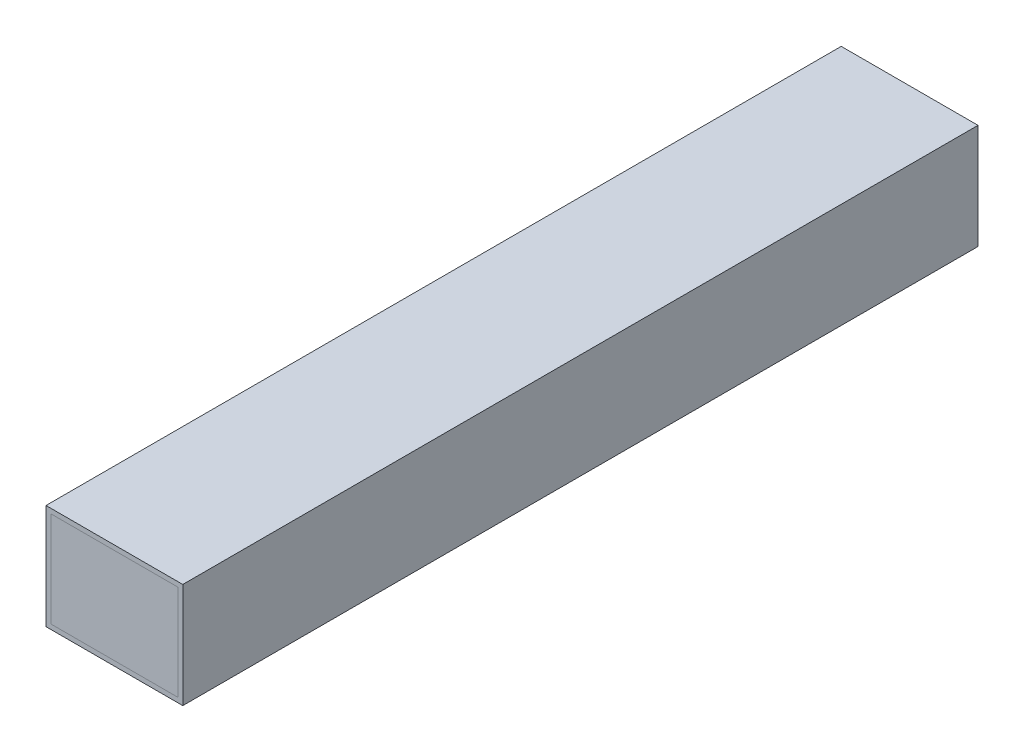
ISO-10303-21;
HEADER;
FILE_DESCRIPTION(('STEP AP214'),'2;1');
FILE_NAME('part.step','',(''),(''),'','','');
FILE_SCHEMA(('AUTOMOTIVE_DESIGN { 1 0 10303 214 1 1 1 1 }'));
ENDSEC;
DATA;
#1=APPLICATION_CONTEXT('core data for automotive mechanical design processes');
#2=APPLICATION_PROTOCOL_DEFINITION('international standard','automotive_design',2000,#1);
#3=PRODUCT_CONTEXT('',#1,'mechanical');
#4=PRODUCT('Part','Part','',(#3));
#5=PRODUCT_RELATED_PRODUCT_CATEGORY('part','',(#4));
#6=PRODUCT_DEFINITION_FORMATION('','',#4);
#7=PRODUCT_DEFINITION_CONTEXT('part definition',#1,'design');
#8=PRODUCT_DEFINITION('design','',#6,#7);
#9=PRODUCT_DEFINITION_SHAPE('','',#8);
#10=(LENGTH_UNIT() NAMED_UNIT(*) SI_UNIT(.MILLI.,.METRE.));
#11=(NAMED_UNIT(*) PLANE_ANGLE_UNIT() SI_UNIT($,.RADIAN.));
#12=(NAMED_UNIT(*) SI_UNIT($,.STERADIAN.) SOLID_ANGLE_UNIT());
#13=UNCERTAINTY_MEASURE_WITH_UNIT(LENGTH_MEASURE(1.E-05),#10,'distance_accuracy_value','');
#14=(GEOMETRIC_REPRESENTATION_CONTEXT(3) GLOBAL_UNCERTAINTY_ASSIGNED_CONTEXT((#13)) GLOBAL_UNIT_ASSIGNED_CONTEXT((#10,
#11,#12)) REPRESENTATION_CONTEXT('',''));
#15=CARTESIAN_POINT('',(0.,0.,0.));
#16=DIRECTION('',(0.,0.,1.));
#17=DIRECTION('',(1.,0.,0.));
#18=AXIS2_PLACEMENT_3D('',#15,#16,#17);
#19=CARTESIAN_POINT('',(-20.,15.,125.));
#20=DIRECTION('',(1.,0.,0.));
#21=DIRECTION('',(0.,0.,-1.));
#22=AXIS2_PLACEMENT_3D('',#19,#20,#21);
#23=PLANE('',#22);
#24=DIRECTION('',(0.,-1.,0.));
#25=VECTOR('',#24,1.);
#26=CARTESIAN_POINT('',(-20.,15.,-125.));
#27=LINE('',#26,#25);
#28=CARTESIAN_POINT('',(-20.,15.,-125.));
#29=VERTEX_POINT('',#28);
#30=CARTESIAN_POINT('',(-20.,-16.000580385734,-125.));
#31=VERTEX_POINT('',#30);
#32=EDGE_CURVE('E135',#29,#31,#27,.T.);
#33=ORIENTED_EDGE('',*,*,#32,.T.);
#34=DIRECTION('',(0.,0.,-1.));
#35=VECTOR('',#34,1.);
#36=CARTESIAN_POINT('',(-20.,-16.000580385734,125.));
#37=LINE('',#36,#35);
#38=CARTESIAN_POINT('',(-20.,-16.000580385734,125.));
#39=VERTEX_POINT('',#38);
#40=EDGE_CURVE('E13',#39,#31,#37,.T.);
#41=ORIENTED_EDGE('',*,*,#40,.F.);
#42=DIRECTION('',(0.,-1.,0.));
#43=VECTOR('',#42,1.);
#44=CARTESIAN_POINT('',(-20.,15.,125.));
#45=LINE('',#44,#43);
#46=CARTESIAN_POINT('',(-20.,15.,125.));
#47=VERTEX_POINT('',#46);
#48=EDGE_CURVE('E123',#47,#39,#45,.T.);
#49=ORIENTED_EDGE('',*,*,#48,.F.);
#50=DIRECTION('',(0.,0.,-1.));
#51=VECTOR('',#50,1.);
#52=CARTESIAN_POINT('',(-20.,15.,125.));
#53=LINE('',#52,#51);
#54=EDGE_CURVE('E131',#47,#29,#53,.T.);
#55=ORIENTED_EDGE('',*,*,#54,.T.);
#56=EDGE_LOOP('',(#33,#41,#49,#55));
#57=FACE_BOUND('',#56,.T.);
#58=ADVANCED_FACE('F72',(#57),#23,.F.);
#59=CARTESIAN_POINT('',(-20.,-16.000580385734,125.));
#60=DIRECTION('',(0.,1.,0.));
#61=DIRECTION('',(0.,0.,1.));
#62=AXIS2_PLACEMENT_3D('',#59,#60,#61);
#63=PLANE('',#62);
#64=DIRECTION('',(1.,0.,0.));
#65=VECTOR('',#64,1.);
#66=CARTESIAN_POINT('',(-20.,-16.000580385734,-125.));
#67=LINE('',#66,#65);
#68=CARTESIAN_POINT('',(19.9966618023375,-16.000580385734,-125.));
#69=VERTEX_POINT('',#68);
#70=EDGE_CURVE('E127',#31,#69,#67,.T.);
#71=ORIENTED_EDGE('',*,*,#70,.T.);
#72=DIRECTION('',(0.,0.,-1.));
#73=VECTOR('',#72,1.);
#74=CARTESIAN_POINT('',(19.9966618023375,-16.000580385734,125.));
#75=LINE('',#74,#73);
#76=CARTESIAN_POINT('',(19.9966618023375,-16.000580385734,125.));
#77=VERTEX_POINT('',#76);
#78=EDGE_CURVE('E80',#77,#69,#75,.T.);
#79=ORIENTED_EDGE('',*,*,#78,.F.);
#80=DIRECTION('',(1.,0.,0.));
#81=VECTOR('',#80,1.);
#82=CARTESIAN_POINT('',(-20.,-16.000580385734,125.));
#83=LINE('',#82,#81);
#84=EDGE_CURVE('E118',#39,#77,#83,.T.);
#85=ORIENTED_EDGE('',*,*,#84,.F.);
#86=ORIENTED_EDGE('',*,*,#40,.T.);
#87=EDGE_LOOP('',(#71,#79,#85,#86));
#88=FACE_BOUND('',#87,.T.);
#89=ADVANCED_FACE('F126',(#88),#63,.F.);
#90=CARTESIAN_POINT('',(19.9966618023375,15.,125.));
#91=DIRECTION('',(-1.,0.,0.));
#92=DIRECTION('',(0.,-1.,0.));
#93=AXIS2_PLACEMENT_3D('',#90,#91,#92);
#94=PLANE('',#93);
#95=DIRECTION('',(0.,1.,0.));
#96=VECTOR('',#95,1.);
#97=CARTESIAN_POINT('',(19.9966618023375,15.,-125.));
#98=LINE('',#97,#96);
#99=CARTESIAN_POINT('',(19.9966618023375,15.,-125.));
#100=VERTEX_POINT('',#99);
#101=EDGE_CURVE('E105',#69,#100,#98,.T.);
#102=ORIENTED_EDGE('',*,*,#101,.T.);
#103=DIRECTION('',(0.,0.,-1.));
#104=VECTOR('',#103,1.);
#105=CARTESIAN_POINT('',(19.9966618023375,15.,125.));
#106=LINE('',#105,#104);
#107=CARTESIAN_POINT('',(19.9966618023375,15.,125.));
#108=VERTEX_POINT('',#107);
#109=EDGE_CURVE('E128',#108,#100,#106,.T.);
#110=ORIENTED_EDGE('',*,*,#109,.F.);
#111=DIRECTION('',(0.,1.,0.));
#112=VECTOR('',#111,1.);
#113=CARTESIAN_POINT('',(19.9966618023375,15.,125.));
#114=LINE('',#113,#112);
#115=EDGE_CURVE('E121',#77,#108,#114,.T.);
#116=ORIENTED_EDGE('',*,*,#115,.F.);
#117=ORIENTED_EDGE('',*,*,#78,.T.);
#118=EDGE_LOOP('',(#102,#110,#116,#117));
#119=FACE_BOUND('',#118,.T.);
#120=ADVANCED_FACE('F129',(#119),#94,.F.);
#121=CARTESIAN_POINT('',(-20.,15.,125.));
#122=DIRECTION('',(0.,-1.,0.));
#123=DIRECTION('',(0.,0.,-1.));
#124=AXIS2_PLACEMENT_3D('',#121,#122,#123);
#125=PLANE('',#124);
#126=DIRECTION('',(-1.,0.,0.));
#127=VECTOR('',#126,1.);
#128=CARTESIAN_POINT('',(-20.,15.,-125.));
#129=LINE('',#128,#127);
#130=EDGE_CURVE('E111',#100,#29,#129,.T.);
#131=ORIENTED_EDGE('',*,*,#130,.T.);
#132=ORIENTED_EDGE('',*,*,#54,.F.);
#133=DIRECTION('',(-1.,0.,0.));
#134=VECTOR('',#133,1.);
#135=CARTESIAN_POINT('',(-20.,15.,125.));
#136=LINE('',#135,#134);
#137=EDGE_CURVE('E88',#108,#47,#136,.T.);
#138=ORIENTED_EDGE('',*,*,#137,.F.);
#139=ORIENTED_EDGE('',*,*,#109,.T.);
#140=EDGE_LOOP('',(#131,#132,#138,#139));
#141=FACE_BOUND('',#140,.T.);
#142=ADVANCED_FACE('F142',(#141),#125,.F.);
#143=CARTESIAN_POINT('',(0.,0.,125.));
#144=DIRECTION('',(0.,0.,1.));
#145=DIRECTION('',(1.,0.,0.));
#146=AXIS2_PLACEMENT_3D('',#143,#144,#145);
#147=PLANE('',#146);
#148=ORIENTED_EDGE('',*,*,#48,.T.);
#149=ORIENTED_EDGE('',*,*,#84,.T.);
#150=ORIENTED_EDGE('',*,*,#115,.T.);
#151=ORIENTED_EDGE('',*,*,#137,.T.);
#152=EDGE_LOOP('',(#148,#149,#150,#151));
#153=FACE_BOUND('',#152,.T.);
#154=ADVANCED_FACE('F119',(#153),#147,.T.);
#155=CARTESIAN_POINT('',(0.,0.,-125.));
#156=DIRECTION('',(0.,0.,1.));
#157=DIRECTION('',(1.,0.,0.));
#158=AXIS2_PLACEMENT_3D('',#155,#156,#157);
#159=PLANE('',#158);
#160=ORIENTED_EDGE('',*,*,#32,.F.);
#161=ORIENTED_EDGE('',*,*,#130,.F.);
#162=ORIENTED_EDGE('',*,*,#101,.F.);
#163=ORIENTED_EDGE('',*,*,#70,.F.);
#164=EDGE_LOOP('',(#160,#161,#162,#163));
#165=FACE_BOUND('',#164,.T.);
#166=ADVANCED_FACE('F145',(#165),#159,.F.);
#167=CLOSED_SHELL('',(#58,#89,#120,#142,#154,#166));
#168=MANIFOLD_SOLID_BREP('B2',#167);
#169=CARTESIAN_POINT('',(0.,0.,100.));
#170=DIRECTION('',(0.,0.,1.));
#171=DIRECTION('',(1.,0.,0.));
#172=AXIS2_PLACEMENT_3D('',#169,#170,#171);
#173=CYLINDRICAL_SURFACE('',#172,0.300000000000001);
#174=CARTESIAN_POINT('',(0.,0.,90.0006526384106));
#175=DIRECTION('',(0.,0.,1.));
#176=DIRECTION('',(1.,0.,0.));
#177=AXIS2_PLACEMENT_3D('',#174,#175,#176);
#178=CIRCLE('',#177,0.300000000000003);
#179=CARTESIAN_POINT('',(0.300000000000003,0.,90.0006526384106));
#180=VERTEX_POINT('',#179);
#181=EDGE_CURVE('E227',#180,#180,#178,.T.);
#182=ORIENTED_EDGE('',*,*,#181,.F.);
#183=EDGE_LOOP('',(#182));
#184=FACE_BOUND('',#183,.T.);
#185=CARTESIAN_POINT('',(0.,0.,-33.0761005211329));
#186=DIRECTION('',(0.,0.,-1.));
#187=DIRECTION('',(-1.,0.,0.));
#188=AXIS2_PLACEMENT_3D('',#185,#186,#187);
#189=CIRCLE('',#188,0.300000000000001);
#190=CARTESIAN_POINT('',(-0.300000000000001,0.,-33.0761005211329));
#191=VERTEX_POINT('',#190);
#192=EDGE_CURVE('E70',#191,#191,#189,.F.);
#193=ORIENTED_EDGE('',*,*,#192,.T.);
#194=EDGE_LOOP('',(#193));
#195=FACE_BOUND('',#194,.T.);
#196=ADVANCED_FACE('F205',(#184,#195),#173,.T.);
#197=CARTESIAN_POINT('',(0.,0.,90.0006526384106));
#198=DIRECTION('',(0.,0.,1.));
#199=DIRECTION('',(1.,0.,0.));
#200=AXIS2_PLACEMENT_3D('',#197,#198,#199);
#201=TOROIDAL_SURFACE('',#200,0.35,0.0499999999999973);
#202=CARTESIAN_POINT('',(0.,0.,90.0506526384106));
#203=DIRECTION('',(0.,0.,1.));
#204=DIRECTION('',(1.,0.,0.));
#205=AXIS2_PLACEMENT_3D('',#202,#203,#204);
#206=CIRCLE('',#205,0.35);
#207=CARTESIAN_POINT('',(0.35,0.,90.0506526384106));
#208=VERTEX_POINT('',#207);
#209=EDGE_CURVE('E224',#208,#208,#206,.T.);
#210=ORIENTED_EDGE('',*,*,#209,.F.);
#211=EDGE_LOOP('',(#210));
#212=FACE_BOUND('',#211,.T.);
#213=ORIENTED_EDGE('',*,*,#181,.T.);
#214=EDGE_LOOP('',(#213));
#215=FACE_BOUND('',#214,.T.);
#216=ADVANCED_FACE('F245',(#212,#215),#201,.F.);
#217=CARTESIAN_POINT('',(-2.64008499641477,0.,90.0506526384106));
#218=DIRECTION('',(0.,0.,1.));
#219=DIRECTION('',(1.,0.,0.));
#220=AXIS2_PLACEMENT_3D('',#217,#218,#219);
#221=PLANE('',#220);
#222=CARTESIAN_POINT('',(0.,0.,90.0506526384106));
#223=DIRECTION('',(0.,0.,1.));
#224=DIRECTION('',(1.,0.,0.));
#225=AXIS2_PLACEMENT_3D('',#222,#223,#224);
#226=CIRCLE('',#225,2.64008499641477);
#227=CARTESIAN_POINT('',(2.64008499641477,0.,90.0506526384106));
#228=VERTEX_POINT('',#227);
#229=EDGE_CURVE('E222',#228,#228,#226,.T.);
#230=ORIENTED_EDGE('',*,*,#229,.F.);
#231=EDGE_LOOP('',(#230));
#232=FACE_BOUND('',#231,.T.);
#233=ORIENTED_EDGE('',*,*,#209,.T.);
#234=EDGE_LOOP('',(#233));
#235=FACE_BOUND('',#234,.T.);
#236=ADVANCED_FACE('F218',(#232,#235),#221,.F.);
#237=CARTESIAN_POINT('',(0.,0.,90.0506526384106));
#238=DIRECTION('',(0.,0.,-1.));
#239=DIRECTION('',(-1.,0.,0.));
#240=AXIS2_PLACEMENT_3D('',#237,#238,#239);
#241=CONICAL_SURFACE('',#240,2.64008499641477,0.259375146902593);
#242=CARTESIAN_POINT('',(0.,0.,100.));
#243=VERTEX_POINT('',#242);
#244=VERTEX_LOOP('',#243);
#245=FACE_BOUND('',#244,.T.);
#246=ORIENTED_EDGE('',*,*,#229,.T.);
#247=EDGE_LOOP('',(#246));
#248=FACE_BOUND('',#247,.T.);
#249=ADVANCED_FACE('F215',(#245,#248),#241,.T.);
#250=CARTESIAN_POINT('',(0.,0.,-40.7234793438795));
#251=DIRECTION('',(-1.,0.,0.));
#252=DIRECTION('',(0.,0.,-1.));
#253=AXIS2_PLACEMENT_3D('',#250,#251,#252);
#254=SPHERICAL_SURFACE('',#253,7.65326092973403);
#255=CARTESIAN_POINT('',(0.,0.,-40.7234793438795));
#256=DIRECTION('',(0.,0.,1.));
#257=DIRECTION('',(1.,0.,0.));
#258=AXIS2_PLACEMENT_3D('',#255,#256,#257);
#259=SPHERICAL_SURFACE('',#258,7.65326092973403);
#260=CARTESIAN_POINT('',(0.,0.,-48.3708581666261));
#261=DIRECTION('',(0.,0.,1.));
#262=DIRECTION('',(1.,0.,0.));
#263=AXIS2_PLACEMENT_3D('',#260,#261,#262);
#264=CIRCLE('',#263,0.300000000000001);
#265=CARTESIAN_POINT('',(0.300000000000001,0.,-48.3708581666261));
#266=VERTEX_POINT('',#265);
#267=EDGE_CURVE('E212',#266,#266,#264,.F.);
#268=ORIENTED_EDGE('',*,*,#267,.F.);
#269=EDGE_LOOP('',(#268));
#270=FACE_BOUND('',#269,.T.);
#271=ORIENTED_EDGE('',*,*,#192,.F.);
#272=EDGE_LOOP('',(#271));
#273=FACE_BOUND('',#272,.T.);
#274=ADVANCED_FACE('F207',(#270,#273),#259,.T.);
#275=CARTESIAN_POINT('',(0.,0.,-100.));
#276=DIRECTION('',(0.,0.,1.));
#277=DIRECTION('',(1.,0.,0.));
#278=AXIS2_PLACEMENT_3D('',#275,#276,#277);
#279=PLANE('',#278);
#280=CARTESIAN_POINT('',(0.,0.,-100.));
#281=DIRECTION('',(0.,0.,1.));
#282=DIRECTION('',(1.,0.,0.));
#283=AXIS2_PLACEMENT_3D('',#280,#281,#282);
#284=CIRCLE('',#283,0.3);
#285=CARTESIAN_POINT('',(0.3,0.,-100.));
#286=VERTEX_POINT('',#285);
#287=EDGE_CURVE('E232',#286,#286,#284,.T.);
#288=ORIENTED_EDGE('',*,*,#287,.F.);
#289=EDGE_LOOP('',(#288));
#290=FACE_BOUND('',#289,.T.);
#291=ADVANCED_FACE('F241',(#290),#279,.F.);
#292=ORIENTED_EDGE('',*,*,#287,.T.);
#293=EDGE_LOOP('',(#292));
#294=FACE_BOUND('',#293,.T.);
#295=ORIENTED_EDGE('',*,*,#267,.T.);
#296=EDGE_LOOP('',(#295));
#297=FACE_BOUND('',#296,.T.);
#298=ADVANCED_FACE('F237',(#294,#297),#173,.T.);
#299=CLOSED_SHELL('',(#196,#216,#236,#249,#274,#291,#298));
#300=MANIFOLD_SOLID_BREP('B7',#299);
#301=CARTESIAN_POINT('',(20.,-15.,-25.));
#302=DIRECTION('',(0.,0.,-1.));
#303=DIRECTION('',(-1.,0.,0.));
#304=AXIS2_PLACEMENT_3D('',#301,#302,#303);
#305=PLANE('',#304);
#306=DIRECTION('',(0.,-1.,0.));
#307=VECTOR('',#306,1.);
#308=CARTESIAN_POINT('',(-20.,-15.,-25.));
#309=LINE('',#308,#307);
#310=CARTESIAN_POINT('',(-20.,-15.,-25.));
#311=VERTEX_POINT('',#310);
#312=CARTESIAN_POINT('',(-20.,-16.,-25.));
#313=VERTEX_POINT('',#312);
#314=EDGE_CURVE('E379',#311,#313,#309,.T.);
#315=ORIENTED_EDGE('',*,*,#314,.T.);
#316=DIRECTION('',(-1.,0.,0.));
#317=VECTOR('',#316,1.);
#318=CARTESIAN_POINT('',(20.,-16.,-25.));
#319=LINE('',#318,#317);
#320=CARTESIAN_POINT('',(20.,-16.,-25.));
#321=VERTEX_POINT('',#320);
#322=EDGE_CURVE('E203',#321,#313,#319,.T.);
#323=ORIENTED_EDGE('',*,*,#322,.F.);
#324=DIRECTION('',(0.,-1.,0.));
#325=VECTOR('',#324,1.);
#326=CARTESIAN_POINT('',(20.,-15.,-25.));
#327=LINE('',#326,#325);
#328=CARTESIAN_POINT('',(20.,-15.,-25.));
#329=VERTEX_POINT('',#328);
#330=EDGE_CURVE('E367',#329,#321,#327,.T.);
#331=ORIENTED_EDGE('',*,*,#330,.F.);
#332=DIRECTION('',(-1.,0.,0.));
#333=VECTOR('',#332,1.);
#334=CARTESIAN_POINT('',(20.,-15.,-25.));
#335=LINE('',#334,#333);
#336=EDGE_CURVE('E375',#329,#311,#335,.T.);
#337=ORIENTED_EDGE('',*,*,#336,.T.);
#338=EDGE_LOOP('',(#315,#323,#331,#337));
#339=FACE_BOUND('',#338,.T.);
#340=ADVANCED_FACE('F316',(#339),#305,.F.);
#341=CARTESIAN_POINT('',(20.,-16.,-25.));
#342=DIRECTION('',(0.,1.,0.));
#343=DIRECTION('',(0.,0.,1.));
#344=AXIS2_PLACEMENT_3D('',#341,#342,#343);
#345=PLANE('',#344);
#346=DIRECTION('',(0.,0.,-1.));
#347=VECTOR('',#346,1.);
#348=CARTESIAN_POINT('',(-20.,-16.,-25.));
#349=LINE('',#348,#347);
#350=CARTESIAN_POINT('',(-20.,-16.,-55.));
#351=VERTEX_POINT('',#350);
#352=EDGE_CURVE('E371',#313,#351,#349,.T.);
#353=ORIENTED_EDGE('',*,*,#352,.T.);
#354=DIRECTION('',(-1.,0.,0.));
#355=VECTOR('',#354,1.);
#356=CARTESIAN_POINT('',(20.,-16.,-55.));
#357=LINE('',#356,#355);
#358=CARTESIAN_POINT('',(20.,-16.,-55.));
#359=VERTEX_POINT('',#358);
#360=EDGE_CURVE('E324',#359,#351,#357,.T.);
#361=ORIENTED_EDGE('',*,*,#360,.F.);
#362=DIRECTION('',(0.,0.,-1.));
#363=VECTOR('',#362,1.);
#364=CARTESIAN_POINT('',(20.,-16.,-25.));
#365=LINE('',#364,#363);
#366=EDGE_CURVE('E362',#321,#359,#365,.T.);
#367=ORIENTED_EDGE('',*,*,#366,.F.);
#368=ORIENTED_EDGE('',*,*,#322,.T.);
#369=EDGE_LOOP('',(#353,#361,#367,#368));
#370=FACE_BOUND('',#369,.T.);
#371=ADVANCED_FACE('F370',(#370),#345,.F.);
#372=CARTESIAN_POINT('',(20.,-15.,-55.));
#373=DIRECTION('',(0.,0.,1.));
#374=DIRECTION('',(1.,0.,0.));
#375=AXIS2_PLACEMENT_3D('',#372,#373,#374);
#376=PLANE('',#375);
#377=DIRECTION('',(0.,1.,0.));
#378=VECTOR('',#377,1.);
#379=CARTESIAN_POINT('',(-20.,-15.,-55.));
#380=LINE('',#379,#378);
#381=CARTESIAN_POINT('',(-20.,-15.,-55.));
#382=VERTEX_POINT('',#381);
#383=EDGE_CURVE('E349',#351,#382,#380,.T.);
#384=ORIENTED_EDGE('',*,*,#383,.T.);
#385=DIRECTION('',(-1.,0.,0.));
#386=VECTOR('',#385,1.);
#387=CARTESIAN_POINT('',(20.,-15.,-55.));
#388=LINE('',#387,#386);
#389=CARTESIAN_POINT('',(20.,-15.,-55.));
#390=VERTEX_POINT('',#389);
#391=EDGE_CURVE('E372',#390,#382,#388,.T.);
#392=ORIENTED_EDGE('',*,*,#391,.F.);
#393=DIRECTION('',(0.,1.,0.));
#394=VECTOR('',#393,1.);
#395=CARTESIAN_POINT('',(20.,-15.,-55.));
#396=LINE('',#395,#394);
#397=EDGE_CURVE('E365',#359,#390,#396,.T.);
#398=ORIENTED_EDGE('',*,*,#397,.F.);
#399=ORIENTED_EDGE('',*,*,#360,.T.);
#400=EDGE_LOOP('',(#384,#392,#398,#399));
#401=FACE_BOUND('',#400,.T.);
#402=ADVANCED_FACE('F373',(#401),#376,.F.);
#403=CARTESIAN_POINT('',(20.,-15.,-25.));
#404=DIRECTION('',(0.,-1.,0.));
#405=DIRECTION('',(0.,0.,-1.));
#406=AXIS2_PLACEMENT_3D('',#403,#404,#405);
#407=PLANE('',#406);
#408=DIRECTION('',(0.,0.,1.));
#409=VECTOR('',#408,1.);
#410=CARTESIAN_POINT('',(-20.,-15.,-25.));
#411=LINE('',#410,#409);
#412=EDGE_CURVE('E355',#382,#311,#411,.T.);
#413=ORIENTED_EDGE('',*,*,#412,.T.);
#414=ORIENTED_EDGE('',*,*,#336,.F.);
#415=DIRECTION('',(0.,0.,1.));
#416=VECTOR('',#415,1.);
#417=CARTESIAN_POINT('',(20.,-15.,-25.));
#418=LINE('',#417,#416);
#419=EDGE_CURVE('E332',#390,#329,#418,.T.);
#420=ORIENTED_EDGE('',*,*,#419,.F.);
#421=ORIENTED_EDGE('',*,*,#391,.T.);
#422=EDGE_LOOP('',(#413,#414,#420,#421));
#423=FACE_BOUND('',#422,.T.);
#424=ADVANCED_FACE('F386',(#423),#407,.F.);
#425=CARTESIAN_POINT('',(20.,0.,0.));
#426=DIRECTION('',(1.,0.,0.));
#427=DIRECTION('',(0.,0.,-1.));
#428=AXIS2_PLACEMENT_3D('',#425,#426,#427);
#429=PLANE('',#428);
#430=ORIENTED_EDGE('',*,*,#330,.T.);
#431=ORIENTED_EDGE('',*,*,#366,.T.);
#432=ORIENTED_EDGE('',*,*,#397,.T.);
#433=ORIENTED_EDGE('',*,*,#419,.T.);
#434=EDGE_LOOP('',(#430,#431,#432,#433));
#435=FACE_BOUND('',#434,.T.);
#436=ADVANCED_FACE('F363',(#435),#429,.T.);
#437=CARTESIAN_POINT('',(-20.,0.,0.));
#438=DIRECTION('',(1.,0.,0.));
#439=DIRECTION('',(0.,0.,-1.));
#440=AXIS2_PLACEMENT_3D('',#437,#438,#439);
#441=PLANE('',#440);
#442=ORIENTED_EDGE('',*,*,#314,.F.);
#443=ORIENTED_EDGE('',*,*,#412,.F.);
#444=ORIENTED_EDGE('',*,*,#383,.F.);
#445=ORIENTED_EDGE('',*,*,#352,.F.);
#446=EDGE_LOOP('',(#442,#443,#444,#445));
#447=FACE_BOUND('',#446,.T.);
#448=ADVANCED_FACE('F389',(#447),#441,.F.);
#449=CLOSED_SHELL('',(#340,#371,#402,#424,#436,#448));
#450=MANIFOLD_SOLID_BREP('B64',#449);
#451=CARTESIAN_POINT('',(20.,-15.,25.));
#452=DIRECTION('',(0.,0.,1.));
#453=DIRECTION('',(0.,-1.,0.));
#454=AXIS2_PLACEMENT_3D('',#451,#452,#453);
#455=PLANE('',#454);
#456=DIRECTION('',(0.,1.,0.));
#457=VECTOR('',#456,1.);
#458=CARTESIAN_POINT('',(-20.,-15.,25.));
#459=LINE('',#458,#457);
#460=CARTESIAN_POINT('',(-20.,-16.,25.));
#461=VERTEX_POINT('',#460);
#462=CARTESIAN_POINT('',(-20.,-15.,25.));
#463=VERTEX_POINT('',#462);
#464=EDGE_CURVE('E512',#461,#463,#459,.T.);
#465=ORIENTED_EDGE('',*,*,#464,.T.);
#466=DIRECTION('',(-1.,0.,0.));
#467=VECTOR('',#466,1.);
#468=CARTESIAN_POINT('',(20.,-15.,25.));
#469=LINE('',#468,#467);
#470=CARTESIAN_POINT('',(20.,-15.,25.));
#471=VERTEX_POINT('',#470);
#472=EDGE_CURVE('E314',#471,#463,#469,.T.);
#473=ORIENTED_EDGE('',*,*,#472,.F.);
#474=DIRECTION('',(0.,1.,0.));
#475=VECTOR('',#474,1.);
#476=CARTESIAN_POINT('',(20.,-15.,25.));
#477=LINE('',#476,#475);
#478=CARTESIAN_POINT('',(20.,-16.,25.));
#479=VERTEX_POINT('',#478);
#480=EDGE_CURVE('E500',#479,#471,#477,.T.);
#481=ORIENTED_EDGE('',*,*,#480,.F.);
#482=DIRECTION('',(-1.,0.,0.));
#483=VECTOR('',#482,1.);
#484=CARTESIAN_POINT('',(20.,-16.,25.));
#485=LINE('',#484,#483);
#486=EDGE_CURVE('E508',#479,#461,#485,.T.);
#487=ORIENTED_EDGE('',*,*,#486,.T.);
#488=EDGE_LOOP('',(#465,#473,#481,#487));
#489=FACE_BOUND('',#488,.T.);
#490=ADVANCED_FACE('F449',(#489),#455,.F.);
#491=CARTESIAN_POINT('',(20.,-15.,25.));
#492=DIRECTION('',(0.,-1.,0.));
#493=DIRECTION('',(0.,0.,-1.));
#494=AXIS2_PLACEMENT_3D('',#491,#492,#493);
#495=PLANE('',#494);
#496=DIRECTION('',(0.,0.,1.));
#497=VECTOR('',#496,1.);
#498=CARTESIAN_POINT('',(-20.,-15.,25.));
#499=LINE('',#498,#497);
#500=CARTESIAN_POINT('',(-20.,-15.,55.));
#501=VERTEX_POINT('',#500);
#502=EDGE_CURVE('E504',#463,#501,#499,.T.);
#503=ORIENTED_EDGE('',*,*,#502,.T.);
#504=DIRECTION('',(-1.,0.,0.));
#505=VECTOR('',#504,1.);
#506=CARTESIAN_POINT('',(20.,-15.,55.));
#507=LINE('',#506,#505);
#508=CARTESIAN_POINT('',(20.,-15.,55.));
#509=VERTEX_POINT('',#508);
#510=EDGE_CURVE('E457',#509,#501,#507,.T.);
#511=ORIENTED_EDGE('',*,*,#510,.F.);
#512=DIRECTION('',(0.,0.,1.));
#513=VECTOR('',#512,1.);
#514=CARTESIAN_POINT('',(20.,-15.,25.));
#515=LINE('',#514,#513);
#516=EDGE_CURVE('E495',#471,#509,#515,.T.);
#517=ORIENTED_EDGE('',*,*,#516,.F.);
#518=ORIENTED_EDGE('',*,*,#472,.T.);
#519=EDGE_LOOP('',(#503,#511,#517,#518));
#520=FACE_BOUND('',#519,.T.);
#521=ADVANCED_FACE('F503',(#520),#495,.F.);
#522=CARTESIAN_POINT('',(20.,-15.,55.));
#523=DIRECTION('',(0.,0.,-1.));
#524=DIRECTION('',(-1.,0.,0.));
#525=AXIS2_PLACEMENT_3D('',#522,#523,#524);
#526=PLANE('',#525);
#527=DIRECTION('',(0.,-1.,0.));
#528=VECTOR('',#527,1.);
#529=CARTESIAN_POINT('',(-20.,-15.,55.));
#530=LINE('',#529,#528);
#531=CARTESIAN_POINT('',(-20.,-16.,55.));
#532=VERTEX_POINT('',#531);
#533=EDGE_CURVE('E482',#501,#532,#530,.T.);
#534=ORIENTED_EDGE('',*,*,#533,.T.);
#535=DIRECTION('',(-1.,0.,0.));
#536=VECTOR('',#535,1.);
#537=CARTESIAN_POINT('',(20.,-16.,55.));
#538=LINE('',#537,#536);
#539=CARTESIAN_POINT('',(20.,-16.,55.));
#540=VERTEX_POINT('',#539);
#541=EDGE_CURVE('E505',#540,#532,#538,.T.);
#542=ORIENTED_EDGE('',*,*,#541,.F.);
#543=DIRECTION('',(0.,-1.,0.));
#544=VECTOR('',#543,1.);
#545=CARTESIAN_POINT('',(20.,-15.,55.));
#546=LINE('',#545,#544);
#547=EDGE_CURVE('E498',#509,#540,#546,.T.);
#548=ORIENTED_EDGE('',*,*,#547,.F.);
#549=ORIENTED_EDGE('',*,*,#510,.T.);
#550=EDGE_LOOP('',(#534,#542,#548,#549));
#551=FACE_BOUND('',#550,.T.);
#552=ADVANCED_FACE('F506',(#551),#526,.F.);
#553=CARTESIAN_POINT('',(20.,-16.,25.));
#554=DIRECTION('',(0.,1.,0.));
#555=DIRECTION('',(0.,0.,1.));
#556=AXIS2_PLACEMENT_3D('',#553,#554,#555);
#557=PLANE('',#556);
#558=DIRECTION('',(0.,0.,-1.));
#559=VECTOR('',#558,1.);
#560=CARTESIAN_POINT('',(-20.,-16.,25.));
#561=LINE('',#560,#559);
#562=EDGE_CURVE('E488',#532,#461,#561,.T.);
#563=ORIENTED_EDGE('',*,*,#562,.T.);
#564=ORIENTED_EDGE('',*,*,#486,.F.);
#565=DIRECTION('',(0.,0.,-1.));
#566=VECTOR('',#565,1.);
#567=CARTESIAN_POINT('',(20.,-16.,25.));
#568=LINE('',#567,#566);
#569=EDGE_CURVE('E465',#540,#479,#568,.T.);
#570=ORIENTED_EDGE('',*,*,#569,.F.);
#571=ORIENTED_EDGE('',*,*,#541,.T.);
#572=EDGE_LOOP('',(#563,#564,#570,#571));
#573=FACE_BOUND('',#572,.T.);
#574=ADVANCED_FACE('F519',(#573),#557,.F.);
#575=CARTESIAN_POINT('',(20.,0.,0.));
#576=DIRECTION('',(-1.,0.,0.));
#577=DIRECTION('',(0.,0.,1.));
#578=AXIS2_PLACEMENT_3D('',#575,#576,#577);
#579=PLANE('',#578);
#580=ORIENTED_EDGE('',*,*,#480,.T.);
#581=ORIENTED_EDGE('',*,*,#516,.T.);
#582=ORIENTED_EDGE('',*,*,#547,.T.);
#583=ORIENTED_EDGE('',*,*,#569,.T.);
#584=EDGE_LOOP('',(#580,#581,#582,#583));
#585=FACE_BOUND('',#584,.T.);
#586=ADVANCED_FACE('F496',(#585),#579,.F.);
#587=CARTESIAN_POINT('',(-20.,0.,0.));
#588=DIRECTION('',(-1.,0.,0.));
#589=DIRECTION('',(0.,0.,1.));
#590=AXIS2_PLACEMENT_3D('',#587,#588,#589);
#591=PLANE('',#590);
#592=ORIENTED_EDGE('',*,*,#464,.F.);
#593=ORIENTED_EDGE('',*,*,#562,.F.);
#594=ORIENTED_EDGE('',*,*,#533,.F.);
#595=ORIENTED_EDGE('',*,*,#502,.F.);
#596=EDGE_LOOP('',(#592,#593,#594,#595));
#597=FACE_BOUND('',#596,.T.);
#598=ADVANCED_FACE('F522',(#597),#591,.T.);
#599=CLOSED_SHELL('',(#490,#521,#552,#574,#586,#598));
#600=MANIFOLD_SOLID_BREP('B197',#599);
#601=CARTESIAN_POINT('',(20.,-15.,15.));
#602=DIRECTION('',(0.,0.,-1.));
#603=DIRECTION('',(0.,1.,0.));
#604=AXIS2_PLACEMENT_3D('',#601,#602,#603);
#605=PLANE('',#604);
#606=DIRECTION('',(0.,-1.,0.));
#607=VECTOR('',#606,1.);
#608=CARTESIAN_POINT('',(-20.,-15.,15.));
#609=LINE('',#608,#607);
#610=CARTESIAN_POINT('',(-20.,-15.,15.));
#611=VERTEX_POINT('',#610);
#612=CARTESIAN_POINT('',(-20.,-16.,15.));
#613=VERTEX_POINT('',#612);
#614=EDGE_CURVE('E644',#611,#613,#609,.T.);
#615=ORIENTED_EDGE('',*,*,#614,.T.);
#616=DIRECTION('',(-1.,0.,0.));
#617=VECTOR('',#616,1.);
#618=CARTESIAN_POINT('',(20.,-16.,15.));
#619=LINE('',#618,#617);
#620=CARTESIAN_POINT('',(20.,-16.,15.));
#621=VERTEX_POINT('',#620);
#622=EDGE_CURVE('E447',#621,#613,#619,.T.);
#623=ORIENTED_EDGE('',*,*,#622,.F.);
#624=DIRECTION('',(0.,-1.,0.));
#625=VECTOR('',#624,1.);
#626=CARTESIAN_POINT('',(20.,-15.,15.));
#627=LINE('',#626,#625);
#628=CARTESIAN_POINT('',(20.,-15.,15.));
#629=VERTEX_POINT('',#628);
#630=EDGE_CURVE('E632',#629,#621,#627,.T.);
#631=ORIENTED_EDGE('',*,*,#630,.F.);
#632=DIRECTION('',(-1.,0.,0.));
#633=VECTOR('',#632,1.);
#634=CARTESIAN_POINT('',(20.,-15.,15.));
#635=LINE('',#634,#633);
#636=EDGE_CURVE('E640',#629,#611,#635,.T.);
#637=ORIENTED_EDGE('',*,*,#636,.T.);
#638=EDGE_LOOP('',(#615,#623,#631,#637));
#639=FACE_BOUND('',#638,.T.);
#640=ADVANCED_FACE('F581',(#639),#605,.F.);
#641=CARTESIAN_POINT('',(20.,-16.,-15.));
#642=DIRECTION('',(0.,1.,0.));
#643=DIRECTION('',(0.,0.,1.));
#644=AXIS2_PLACEMENT_3D('',#641,#642,#643);
#645=PLANE('',#644);
#646=DIRECTION('',(0.,0.,-1.));
#647=VECTOR('',#646,1.);
#648=CARTESIAN_POINT('',(-20.,-16.,-15.));
#649=LINE('',#648,#647);
#650=CARTESIAN_POINT('',(-20.,-16.,-15.));
#651=VERTEX_POINT('',#650);
#652=EDGE_CURVE('E636',#613,#651,#649,.T.);
#653=ORIENTED_EDGE('',*,*,#652,.T.);
#654=DIRECTION('',(-1.,0.,0.));
#655=VECTOR('',#654,1.);
#656=CARTESIAN_POINT('',(20.,-16.,-15.));
#657=LINE('',#656,#655);
#658=CARTESIAN_POINT('',(20.,-16.,-15.));
#659=VERTEX_POINT('',#658);
#660=EDGE_CURVE('E589',#659,#651,#657,.T.);
#661=ORIENTED_EDGE('',*,*,#660,.F.);
#662=DIRECTION('',(0.,0.,-1.));
#663=VECTOR('',#662,1.);
#664=CARTESIAN_POINT('',(20.,-16.,-15.));
#665=LINE('',#664,#663);
#666=EDGE_CURVE('E627',#621,#659,#665,.T.);
#667=ORIENTED_EDGE('',*,*,#666,.F.);
#668=ORIENTED_EDGE('',*,*,#622,.T.);
#669=EDGE_LOOP('',(#653,#661,#667,#668));
#670=FACE_BOUND('',#669,.T.);
#671=ADVANCED_FACE('F635',(#670),#645,.F.);
#672=CARTESIAN_POINT('',(20.,-15.,-15.));
#673=DIRECTION('',(0.,0.,1.));
#674=DIRECTION('',(0.,-1.,0.));
#675=AXIS2_PLACEMENT_3D('',#672,#673,#674);
#676=PLANE('',#675);
#677=DIRECTION('',(0.,1.,0.));
#678=VECTOR('',#677,1.);
#679=CARTESIAN_POINT('',(-20.,-15.,-15.));
#680=LINE('',#679,#678);
#681=CARTESIAN_POINT('',(-20.,-15.,-15.));
#682=VERTEX_POINT('',#681);
#683=EDGE_CURVE('E614',#651,#682,#680,.T.);
#684=ORIENTED_EDGE('',*,*,#683,.T.);
#685=DIRECTION('',(-1.,0.,0.));
#686=VECTOR('',#685,1.);
#687=CARTESIAN_POINT('',(20.,-15.,-15.));
#688=LINE('',#687,#686);
#689=CARTESIAN_POINT('',(20.,-15.,-15.));
#690=VERTEX_POINT('',#689);
#691=EDGE_CURVE('E637',#690,#682,#688,.T.);
#692=ORIENTED_EDGE('',*,*,#691,.F.);
#693=DIRECTION('',(0.,1.,0.));
#694=VECTOR('',#693,1.);
#695=CARTESIAN_POINT('',(20.,-15.,-15.));
#696=LINE('',#695,#694);
#697=EDGE_CURVE('E630',#659,#690,#696,.T.);
#698=ORIENTED_EDGE('',*,*,#697,.F.);
#699=ORIENTED_EDGE('',*,*,#660,.T.);
#700=EDGE_LOOP('',(#684,#692,#698,#699));
#701=FACE_BOUND('',#700,.T.);
#702=ADVANCED_FACE('F638',(#701),#676,.F.);
#703=CARTESIAN_POINT('',(20.,-15.,-15.));
#704=DIRECTION('',(0.,-1.,0.));
#705=DIRECTION('',(0.,0.,-1.));
#706=AXIS2_PLACEMENT_3D('',#703,#704,#705);
#707=PLANE('',#706);
#708=DIRECTION('',(0.,0.,1.));
#709=VECTOR('',#708,1.);
#710=CARTESIAN_POINT('',(-20.,-15.,-15.));
#711=LINE('',#710,#709);
#712=EDGE_CURVE('E620',#682,#611,#711,.T.);
#713=ORIENTED_EDGE('',*,*,#712,.T.);
#714=ORIENTED_EDGE('',*,*,#636,.F.);
#715=DIRECTION('',(0.,0.,1.));
#716=VECTOR('',#715,1.);
#717=CARTESIAN_POINT('',(20.,-15.,-15.));
#718=LINE('',#717,#716);
#719=EDGE_CURVE('E597',#690,#629,#718,.T.);
#720=ORIENTED_EDGE('',*,*,#719,.F.);
#721=ORIENTED_EDGE('',*,*,#691,.T.);
#722=EDGE_LOOP('',(#713,#714,#720,#721));
#723=FACE_BOUND('',#722,.T.);
#724=ADVANCED_FACE('F651',(#723),#707,.F.);
#725=CARTESIAN_POINT('',(20.,0.,0.));
#726=DIRECTION('',(-1.,0.,0.));
#727=DIRECTION('',(0.,0.,1.));
#728=AXIS2_PLACEMENT_3D('',#725,#726,#727);
#729=PLANE('',#728);
#730=ORIENTED_EDGE('',*,*,#630,.T.);
#731=ORIENTED_EDGE('',*,*,#666,.T.);
#732=ORIENTED_EDGE('',*,*,#697,.T.);
#733=ORIENTED_EDGE('',*,*,#719,.T.);
#734=EDGE_LOOP('',(#730,#731,#732,#733));
#735=FACE_BOUND('',#734,.T.);
#736=ADVANCED_FACE('F628',(#735),#729,.F.);
#737=CARTESIAN_POINT('',(-20.,0.,0.));
#738=DIRECTION('',(-1.,0.,0.));
#739=DIRECTION('',(0.,0.,1.));
#740=AXIS2_PLACEMENT_3D('',#737,#738,#739);
#741=PLANE('',#740);
#742=ORIENTED_EDGE('',*,*,#614,.F.);
#743=ORIENTED_EDGE('',*,*,#712,.F.);
#744=ORIENTED_EDGE('',*,*,#683,.F.);
#745=ORIENTED_EDGE('',*,*,#652,.F.);
#746=EDGE_LOOP('',(#742,#743,#744,#745));
#747=FACE_BOUND('',#746,.T.);
#748=ADVANCED_FACE('F654',(#747),#741,.T.);
#749=CLOSED_SHELL('',(#640,#671,#702,#724,#736,#748));
#750=MANIFOLD_SOLID_BREP('B308',#749);
#751=CARTESIAN_POINT('',(0.,0.,125.));
#752=DIRECTION('',(0.,0.,1.));
#753=DIRECTION('',(1.,0.,0.));
#754=AXIS2_PLACEMENT_3D('',#751,#752,#753);
#755=PLANE('',#754);
#756=DIRECTION('',(0.,1.,0.));
#757=VECTOR('',#756,1.);
#758=CARTESIAN_POINT('',(21.5,15.,125.));
#759=LINE('',#758,#757);
#760=CARTESIAN_POINT('',(21.5,-16.5,125.));
#761=VERTEX_POINT('',#760);
#762=CARTESIAN_POINT('',(21.5,16.5,125.));
#763=VERTEX_POINT('',#762);
#764=EDGE_CURVE('E805',#761,#763,#759,.T.);
#765=ORIENTED_EDGE('',*,*,#764,.T.);
#766=DIRECTION('',(-1.,0.,0.));
#767=VECTOR('',#766,1.);
#768=CARTESIAN_POINT('',(-20.,16.5,125.));
#769=LINE('',#768,#767);
#770=CARTESIAN_POINT('',(-21.5,16.5,125.));
#771=VERTEX_POINT('',#770);
#772=EDGE_CURVE('E808',#763,#771,#769,.T.);
#773=ORIENTED_EDGE('',*,*,#772,.T.);
#774=DIRECTION('',(0.,-1.,0.));
#775=VECTOR('',#774,1.);
#776=CARTESIAN_POINT('',(-21.5,15.,125.));
#777=LINE('',#776,#775);
#778=CARTESIAN_POINT('',(-21.5,-16.5,125.));
#779=VERTEX_POINT('',#778);
#780=EDGE_CURVE('E811',#771,#779,#777,.T.);
#781=ORIENTED_EDGE('',*,*,#780,.T.);
#782=DIRECTION('',(1.,0.,0.));
#783=VECTOR('',#782,1.);
#784=CARTESIAN_POINT('',(-20.,-16.5,125.));
#785=LINE('',#784,#783);
#786=EDGE_CURVE('E813',#779,#761,#785,.T.);
#787=ORIENTED_EDGE('',*,*,#786,.T.);
#788=EDGE_LOOP('',(#765,#773,#781,#787));
#789=FACE_BOUND('',#788,.T.);
#790=DIRECTION('',(-1.,0.,0.));
#791=VECTOR('',#790,1.);
#792=CARTESIAN_POINT('',(-20.,15.,125.));
#793=LINE('',#792,#791);
#794=CARTESIAN_POINT('',(20.,15.,125.));
#795=VERTEX_POINT('',#794);
#796=CARTESIAN_POINT('',(-20.,15.,125.));
#797=VERTEX_POINT('',#796);
#798=EDGE_CURVE('E777',#795,#797,#793,.T.);
#799=ORIENTED_EDGE('',*,*,#798,.F.);
#800=DIRECTION('',(0.,1.,0.));
#801=VECTOR('',#800,1.);
#802=CARTESIAN_POINT('',(20.,15.,125.));
#803=LINE('',#802,#801);
#804=CARTESIAN_POINT('',(20.,-15.,125.));
#805=VERTEX_POINT('',#804);
#806=EDGE_CURVE('E769',#805,#795,#803,.T.);
#807=ORIENTED_EDGE('',*,*,#806,.F.);
#808=DIRECTION('',(1.,0.,0.));
#809=VECTOR('',#808,1.);
#810=CARTESIAN_POINT('',(-20.,-15.,125.));
#811=LINE('',#810,#809);
#812=CARTESIAN_POINT('',(-20.,-15.,125.));
#813=VERTEX_POINT('',#812);
#814=EDGE_CURVE('E791',#813,#805,#811,.T.);
#815=ORIENTED_EDGE('',*,*,#814,.F.);
#816=DIRECTION('',(0.,-1.,0.));
#817=VECTOR('',#816,1.);
#818=CARTESIAN_POINT('',(-20.,15.,125.));
#819=LINE('',#818,#817);
#820=EDGE_CURVE('E789',#797,#813,#819,.T.);
#821=ORIENTED_EDGE('',*,*,#820,.F.);
#822=EDGE_LOOP('',(#799,#807,#815,#821));
#823=FACE_BOUND('',#822,.T.);
#824=ADVANCED_FACE('F704',(#789,#823),#755,.T.);
#825=CARTESIAN_POINT('',(0.,0.,-125.));
#826=DIRECTION('',(0.,0.,1.));
#827=DIRECTION('',(1.,0.,0.));
#828=AXIS2_PLACEMENT_3D('',#825,#826,#827);
#829=PLANE('',#828);
#830=DIRECTION('',(0.,1.,0.));
#831=VECTOR('',#830,1.);
#832=CARTESIAN_POINT('',(21.5,15.,-125.));
#833=LINE('',#832,#831);
#834=CARTESIAN_POINT('',(21.5,-16.5,-125.));
#835=VERTEX_POINT('',#834);
#836=CARTESIAN_POINT('',(21.5,16.5,-125.));
#837=VERTEX_POINT('',#836);
#838=EDGE_CURVE('E785',#835,#837,#833,.T.);
#839=ORIENTED_EDGE('',*,*,#838,.F.);
#840=DIRECTION('',(1.,0.,0.));
#841=VECTOR('',#840,1.);
#842=CARTESIAN_POINT('',(-20.,-16.5,-125.));
#843=LINE('',#842,#841);
#844=CARTESIAN_POINT('',(-21.5,-16.5,-125.));
#845=VERTEX_POINT('',#844);
#846=EDGE_CURVE('E809',#845,#835,#843,.T.);
#847=ORIENTED_EDGE('',*,*,#846,.F.);
#848=DIRECTION('',(0.,-1.,0.));
#849=VECTOR('',#848,1.);
#850=CARTESIAN_POINT('',(-21.5,15.,-125.));
#851=LINE('',#850,#849);
#852=CARTESIAN_POINT('',(-21.5,16.5,-125.));
#853=VERTEX_POINT('',#852);
#854=EDGE_CURVE('E820',#853,#845,#851,.T.);
#855=ORIENTED_EDGE('',*,*,#854,.F.);
#856=DIRECTION('',(-1.,0.,0.));
#857=VECTOR('',#856,1.);
#858=CARTESIAN_POINT('',(-20.,16.5,-125.));
#859=LINE('',#858,#857);
#860=EDGE_CURVE('E818',#837,#853,#859,.T.);
#861=ORIENTED_EDGE('',*,*,#860,.F.);
#862=EDGE_LOOP('',(#839,#847,#855,#861));
#863=FACE_BOUND('',#862,.T.);
#864=DIRECTION('',(0.,1.,0.));
#865=VECTOR('',#864,1.);
#866=CARTESIAN_POINT('',(20.,15.,-125.));
#867=LINE('',#866,#865);
#868=CARTESIAN_POINT('',(20.,-15.,-125.));
#869=VERTEX_POINT('',#868);
#870=CARTESIAN_POINT('',(20.,15.,-125.));
#871=VERTEX_POINT('',#870);
#872=EDGE_CURVE('E727',#869,#871,#867,.T.);
#873=ORIENTED_EDGE('',*,*,#872,.T.);
#874=DIRECTION('',(-1.,0.,0.));
#875=VECTOR('',#874,1.);
#876=CARTESIAN_POINT('',(-20.,15.,-125.));
#877=LINE('',#876,#875);
#878=CARTESIAN_POINT('',(-20.,15.,-125.));
#879=VERTEX_POINT('',#878);
#880=EDGE_CURVE('E784',#871,#879,#877,.T.);
#881=ORIENTED_EDGE('',*,*,#880,.T.);
#882=DIRECTION('',(0.,-1.,0.));
#883=VECTOR('',#882,1.);
#884=CARTESIAN_POINT('',(-20.,15.,-125.));
#885=LINE('',#884,#883);
#886=CARTESIAN_POINT('',(-20.,-15.,-125.));
#887=VERTEX_POINT('',#886);
#888=EDGE_CURVE('E797',#879,#887,#885,.T.);
#889=ORIENTED_EDGE('',*,*,#888,.T.);
#890=DIRECTION('',(1.,0.,0.));
#891=VECTOR('',#890,1.);
#892=CARTESIAN_POINT('',(-20.,-15.,-125.));
#893=LINE('',#892,#891);
#894=EDGE_CURVE('E778',#887,#869,#893,.T.);
#895=ORIENTED_EDGE('',*,*,#894,.T.);
#896=EDGE_LOOP('',(#873,#881,#889,#895));
#897=FACE_BOUND('',#896,.T.);
#898=ADVANCED_FACE('F838',(#863,#897),#829,.F.);
#899=CARTESIAN_POINT('',(21.5,15.,125.));
#900=DIRECTION('',(-1.,0.,0.));
#901=DIRECTION('',(0.,-1.,0.));
#902=AXIS2_PLACEMENT_3D('',#899,#900,#901);
#903=PLANE('',#902);
#904=ORIENTED_EDGE('',*,*,#838,.T.);
#905=DIRECTION('',(0.,0.,-1.));
#906=VECTOR('',#905,1.);
#907=CARTESIAN_POINT('',(21.5,16.5,125.));
#908=LINE('',#907,#906);
#909=EDGE_CURVE('E579',#763,#837,#908,.T.);
#910=ORIENTED_EDGE('',*,*,#909,.F.);
#911=ORIENTED_EDGE('',*,*,#764,.F.);
#912=DIRECTION('',(0.,0.,-1.));
#913=VECTOR('',#912,1.);
#914=CARTESIAN_POINT('',(21.5,-16.5,125.));
#915=LINE('',#914,#913);
#916=EDGE_CURVE('E815',#761,#835,#915,.T.);
#917=ORIENTED_EDGE('',*,*,#916,.T.);
#918=EDGE_LOOP('',(#904,#910,#911,#917));
#919=FACE_BOUND('',#918,.T.);
#920=ADVANCED_FACE('F706',(#919),#903,.F.);
#921=CARTESIAN_POINT('',(-20.,16.5,125.));
#922=DIRECTION('',(0.,-1.,0.));
#923=DIRECTION('',(0.,0.,-1.));
#924=AXIS2_PLACEMENT_3D('',#921,#922,#923);
#925=PLANE('',#924);
#926=ORIENTED_EDGE('',*,*,#860,.T.);
#927=DIRECTION('',(0.,0.,-1.));
#928=VECTOR('',#927,1.);
#929=CARTESIAN_POINT('',(-21.5,16.5,125.));
#930=LINE('',#929,#928);
#931=EDGE_CURVE('E712',#771,#853,#930,.T.);
#932=ORIENTED_EDGE('',*,*,#931,.F.);
#933=ORIENTED_EDGE('',*,*,#772,.F.);
#934=ORIENTED_EDGE('',*,*,#909,.T.);
#935=EDGE_LOOP('',(#926,#932,#933,#934));
#936=FACE_BOUND('',#935,.T.);
#937=ADVANCED_FACE('F848',(#936),#925,.F.);
#938=CARTESIAN_POINT('',(-21.5,15.,125.));
#939=DIRECTION('',(1.,0.,0.));
#940=DIRECTION('',(0.,0.,-1.));
#941=AXIS2_PLACEMENT_3D('',#938,#939,#940);
#942=PLANE('',#941);
#943=ORIENTED_EDGE('',*,*,#854,.T.);
#944=DIRECTION('',(0.,0.,-1.));
#945=VECTOR('',#944,1.);
#946=CARTESIAN_POINT('',(-21.5,-16.5,125.));
#947=LINE('',#946,#945);
#948=EDGE_CURVE('E825',#779,#845,#947,.T.);
#949=ORIENTED_EDGE('',*,*,#948,.F.);
#950=ORIENTED_EDGE('',*,*,#780,.F.);
#951=ORIENTED_EDGE('',*,*,#931,.T.);
#952=EDGE_LOOP('',(#943,#949,#950,#951));
#953=FACE_BOUND('',#952,.T.);
#954=ADVANCED_FACE('F832',(#953),#942,.F.);
#955=CARTESIAN_POINT('',(-20.,-16.5,125.));
#956=DIRECTION('',(0.,1.,0.));
#957=DIRECTION('',(0.,0.,1.));
#958=AXIS2_PLACEMENT_3D('',#955,#956,#957);
#959=PLANE('',#958);
#960=ORIENTED_EDGE('',*,*,#846,.T.);
#961=ORIENTED_EDGE('',*,*,#916,.F.);
#962=ORIENTED_EDGE('',*,*,#786,.F.);
#963=ORIENTED_EDGE('',*,*,#948,.T.);
#964=EDGE_LOOP('',(#960,#961,#962,#963));
#965=FACE_BOUND('',#964,.T.);
#966=ADVANCED_FACE('F842',(#965),#959,.F.);
#967=CARTESIAN_POINT('',(20.,15.,125.));
#968=DIRECTION('',(-1.,0.,0.));
#969=DIRECTION('',(0.,-1.,0.));
#970=AXIS2_PLACEMENT_3D('',#967,#968,#969);
#971=PLANE('',#970);
#972=ORIENTED_EDGE('',*,*,#872,.F.);
#973=DIRECTION('',(0.,0.,-1.));
#974=VECTOR('',#973,1.);
#975=CARTESIAN_POINT('',(20.,-15.,125.));
#976=LINE('',#975,#974);
#977=EDGE_CURVE('E773',#805,#869,#976,.T.);
#978=ORIENTED_EDGE('',*,*,#977,.F.);
#979=ORIENTED_EDGE('',*,*,#806,.T.);
#980=DIRECTION('',(0.,0.,-1.));
#981=VECTOR('',#980,1.);
#982=CARTESIAN_POINT('',(20.,15.,125.));
#983=LINE('',#982,#981);
#984=EDGE_CURVE('E772',#795,#871,#983,.T.);
#985=ORIENTED_EDGE('',*,*,#984,.T.);
#986=EDGE_LOOP('',(#972,#978,#979,#985));
#987=FACE_BOUND('',#986,.T.);
#988=ADVANCED_FACE('F771',(#987),#971,.T.);
#989=CARTESIAN_POINT('',(-20.,15.,125.));
#990=DIRECTION('',(0.,-1.,0.));
#991=DIRECTION('',(0.,0.,-1.));
#992=AXIS2_PLACEMENT_3D('',#989,#990,#991);
#993=PLANE('',#992);
#994=ORIENTED_EDGE('',*,*,#880,.F.);
#995=ORIENTED_EDGE('',*,*,#984,.F.);
#996=ORIENTED_EDGE('',*,*,#798,.T.);
#997=DIRECTION('',(0.,0.,-1.));
#998=VECTOR('',#997,1.);
#999=CARTESIAN_POINT('',(-20.,15.,125.));
#1000=LINE('',#999,#998);
#1001=EDGE_CURVE('E786',#797,#879,#1000,.T.);
#1002=ORIENTED_EDGE('',*,*,#1001,.T.);
#1003=EDGE_LOOP('',(#994,#995,#996,#1002));
#1004=FACE_BOUND('',#1003,.T.);
#1005=ADVANCED_FACE('F781',(#1004),#993,.T.);
#1006=CARTESIAN_POINT('',(-20.,15.,125.));
#1007=DIRECTION('',(1.,0.,0.));
#1008=DIRECTION('',(0.,0.,-1.));
#1009=AXIS2_PLACEMENT_3D('',#1006,#1007,#1008);
#1010=PLANE('',#1009);
#1011=ORIENTED_EDGE('',*,*,#888,.F.);
#1012=ORIENTED_EDGE('',*,*,#1001,.F.);
#1013=ORIENTED_EDGE('',*,*,#820,.T.);
#1014=DIRECTION('',(0.,0.,-1.));
#1015=VECTOR('',#1014,1.);
#1016=CARTESIAN_POINT('',(-20.,-15.,125.));
#1017=LINE('',#1016,#1015);
#1018=EDGE_CURVE('E719',#813,#887,#1017,.T.);
#1019=ORIENTED_EDGE('',*,*,#1018,.T.);
#1020=EDGE_LOOP('',(#1011,#1012,#1013,#1019));
#1021=FACE_BOUND('',#1020,.T.);
#1022=ADVANCED_FACE('F871',(#1021),#1010,.T.);
#1023=CARTESIAN_POINT('',(-20.,-15.,125.));
#1024=DIRECTION('',(0.,1.,0.));
#1025=DIRECTION('',(0.,0.,1.));
#1026=AXIS2_PLACEMENT_3D('',#1023,#1024,#1025);
#1027=PLANE('',#1026);
#1028=ORIENTED_EDGE('',*,*,#894,.F.);
#1029=ORIENTED_EDGE('',*,*,#1018,.F.);
#1030=ORIENTED_EDGE('',*,*,#814,.T.);
#1031=ORIENTED_EDGE('',*,*,#977,.T.);
#1032=EDGE_LOOP('',(#1028,#1029,#1030,#1031));
#1033=FACE_BOUND('',#1032,.T.);
#1034=ADVANCED_FACE('F875',(#1033),#1027,.T.);
#1035=CLOSED_SHELL('',(#824,#898,#920,#937,#954,#966,#988,#1005,#1022,#1034));
#1036=MANIFOLD_SOLID_BREP('B441',#1035);
#1037=ADVANCED_BREP_SHAPE_REPRESENTATION('',(#18,#168,#300,#450,#600,#750,#1036),#14);
#1038=SHAPE_DEFINITION_REPRESENTATION(#9,#1037);
ENDSEC;
END-ISO-10303-21;
